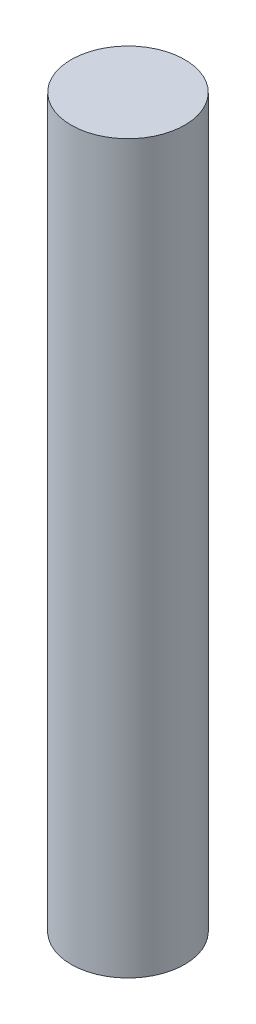
ISO-10303-21;
HEADER;
FILE_DESCRIPTION(('STEP AP214'),'2;1');
FILE_NAME('part.step','',(''),(''),'','','');
FILE_SCHEMA(('AUTOMOTIVE_DESIGN { 1 0 10303 214 1 1 1 1 }'));
ENDSEC;
DATA;
#1=APPLICATION_CONTEXT('core data for automotive mechanical design processes');
#2=APPLICATION_PROTOCOL_DEFINITION('international standard','automotive_design',2000,#1);
#3=PRODUCT_CONTEXT('',#1,'mechanical');
#4=PRODUCT('Part','Part','',(#3));
#5=PRODUCT_RELATED_PRODUCT_CATEGORY('part','',(#4));
#6=PRODUCT_DEFINITION_FORMATION('','',#4);
#7=PRODUCT_DEFINITION_CONTEXT('part definition',#1,'design');
#8=PRODUCT_DEFINITION('design','',#6,#7);
#9=PRODUCT_DEFINITION_SHAPE('','',#8);
#10=(LENGTH_UNIT() NAMED_UNIT(*) SI_UNIT(.MILLI.,.METRE.));
#11=(NAMED_UNIT(*) PLANE_ANGLE_UNIT() SI_UNIT($,.RADIAN.));
#12=(NAMED_UNIT(*) SI_UNIT($,.STERADIAN.) SOLID_ANGLE_UNIT());
#13=UNCERTAINTY_MEASURE_WITH_UNIT(LENGTH_MEASURE(1.E-05),#10,'distance_accuracy_value','');
#14=(GEOMETRIC_REPRESENTATION_CONTEXT(3) GLOBAL_UNCERTAINTY_ASSIGNED_CONTEXT((#13)) GLOBAL_UNIT_ASSIGNED_CONTEXT((#10,
#11,#12)) REPRESENTATION_CONTEXT('',''));
#15=CARTESIAN_POINT('',(0.,0.,0.));
#16=DIRECTION('',(0.,0.,1.));
#17=DIRECTION('',(1.,0.,0.));
#18=AXIS2_PLACEMENT_3D('',#15,#16,#17);
#19=CARTESIAN_POINT('',(0.,6.4,0.));
#20=DIRECTION('',(0.,-1.,0.));
#21=DIRECTION('',(0.,0.,-1.));
#22=AXIS2_PLACEMENT_3D('',#19,#20,#21);
#23=CYLINDRICAL_SURFACE('',#22,0.5);
#24=CARTESIAN_POINT('',(0.,6.4,0.));
#25=DIRECTION('',(0.,1.,0.));
#26=DIRECTION('',(0.,0.,1.));
#27=AXIS2_PLACEMENT_3D('',#24,#25,#26);
#28=CIRCLE('',#27,0.5);
#29=CARTESIAN_POINT('',(0.,6.4,0.5));
#30=VERTEX_POINT('',#29);
#31=EDGE_CURVE('E10',#30,#30,#28,.T.);
#32=ORIENTED_EDGE('',*,*,#31,.F.);
#33=EDGE_LOOP('',(#32));
#34=FACE_BOUND('',#33,.T.);
#35=CARTESIAN_POINT('',(0.,0.,0.));
#36=DIRECTION('',(0.,1.,0.));
#37=DIRECTION('',(0.,0.,1.));
#38=AXIS2_PLACEMENT_3D('',#35,#36,#37);
#39=CIRCLE('',#38,0.5);
#40=CARTESIAN_POINT('',(0.,0.,0.5));
#41=VERTEX_POINT('',#40);
#42=EDGE_CURVE('E37',#41,#41,#39,.T.);
#43=ORIENTED_EDGE('',*,*,#42,.T.);
#44=EDGE_LOOP('',(#43));
#45=FACE_BOUND('',#44,.T.);
#46=ADVANCED_FACE('F34',(#34,#45),#23,.T.);
#47=CARTESIAN_POINT('',(0.,6.4,0.));
#48=DIRECTION('',(0.,1.,0.));
#49=DIRECTION('',(0.,0.,1.));
#50=AXIS2_PLACEMENT_3D('',#47,#48,#49);
#51=PLANE('',#50);
#52=ORIENTED_EDGE('',*,*,#31,.T.);
#53=EDGE_LOOP('',(#52));
#54=FACE_BOUND('',#53,.T.);
#55=ADVANCED_FACE('F49',(#54),#51,.T.);
#56=CARTESIAN_POINT('',(0.,0.,0.));
#57=DIRECTION('',(0.,1.,0.));
#58=DIRECTION('',(0.,0.,1.));
#59=AXIS2_PLACEMENT_3D('',#56,#57,#58);
#60=PLANE('',#59);
#61=ORIENTED_EDGE('',*,*,#42,.F.);
#62=EDGE_LOOP('',(#61));
#63=FACE_BOUND('',#62,.T.);
#64=ADVANCED_FACE('F47',(#63),#60,.F.);
#65=CLOSED_SHELL('',(#46,#55,#64));
#66=MANIFOLD_SOLID_BREP('B2',#65);
#67=ADVANCED_BREP_SHAPE_REPRESENTATION('',(#18,#66),#14);
#68=SHAPE_DEFINITION_REPRESENTATION(#9,#67);
ENDSEC;
END-ISO-10303-21;
